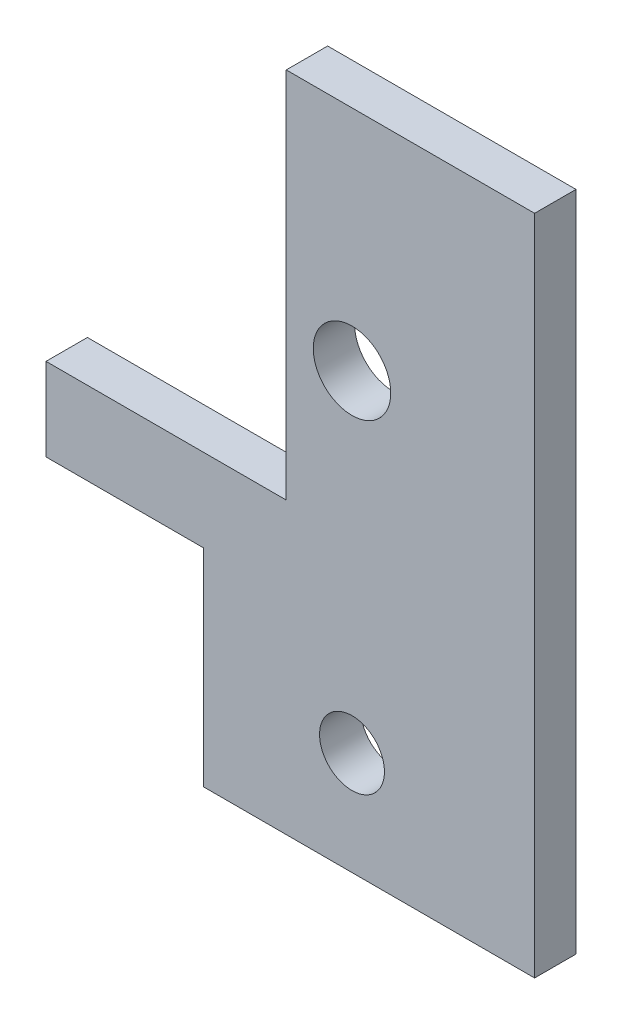
ISO-10303-21;
HEADER;
FILE_DESCRIPTION(('STEP AP214'),'2;1');
FILE_NAME('part.step','',(''),(''),'','','');
FILE_SCHEMA(('AUTOMOTIVE_DESIGN { 1 0 10303 214 1 1 1 1 }'));
ENDSEC;
DATA;
#1=APPLICATION_CONTEXT('core data for automotive mechanical design processes');
#2=APPLICATION_PROTOCOL_DEFINITION('international standard','automotive_design',2000,#1);
#3=PRODUCT_CONTEXT('',#1,'mechanical');
#4=PRODUCT('Part','Part','',(#3));
#5=PRODUCT_RELATED_PRODUCT_CATEGORY('part','',(#4));
#6=PRODUCT_DEFINITION_FORMATION('','',#4);
#7=PRODUCT_DEFINITION_CONTEXT('part definition',#1,'design');
#8=PRODUCT_DEFINITION('design','',#6,#7);
#9=PRODUCT_DEFINITION_SHAPE('','',#8);
#10=(LENGTH_UNIT() NAMED_UNIT(*) SI_UNIT(.MILLI.,.METRE.));
#11=(NAMED_UNIT(*) PLANE_ANGLE_UNIT() SI_UNIT($,.RADIAN.));
#12=(NAMED_UNIT(*) SI_UNIT($,.STERADIAN.) SOLID_ANGLE_UNIT());
#13=UNCERTAINTY_MEASURE_WITH_UNIT(LENGTH_MEASURE(1.E-05),#10,'distance_accuracy_value','');
#14=(GEOMETRIC_REPRESENTATION_CONTEXT(3) GLOBAL_UNCERTAINTY_ASSIGNED_CONTEXT((#13)) GLOBAL_UNIT_ASSIGNED_CONTEXT((#10,
#11,#12)) REPRESENTATION_CONTEXT('',''));
#15=CARTESIAN_POINT('',(0.,0.,0.));
#16=DIRECTION('',(0.,0.,1.));
#17=DIRECTION('',(1.,0.,0.));
#18=AXIS2_PLACEMENT_3D('',#15,#16,#17);
#19=CARTESIAN_POINT('',(18.4276999999991,0.,3.175));
#20=DIRECTION('',(1.,0.,0.));
#21=DIRECTION('',(0.,1.,0.));
#22=AXIS2_PLACEMENT_3D('',#19,#20,#21);
#23=PLANE('',#22);
#24=DIRECTION('',(0.,-1.,0.));
#25=VECTOR('',#24,1.);
#26=CARTESIAN_POINT('',(18.4276999999991,0.,0.));
#27=LINE('',#26,#25);
#28=CARTESIAN_POINT('',(18.4276999999991,9.5377,0.));
#29=VERTEX_POINT('',#28);
#30=CARTESIAN_POINT('',(18.4276999999991,-19.0373,0.));
#31=VERTEX_POINT('',#30);
#32=EDGE_CURVE('E51',#29,#31,#27,.T.);
#33=ORIENTED_EDGE('',*,*,#32,.T.);
#34=DIRECTION('',(0.,0.,-1.));
#35=VECTOR('',#34,1.);
#36=CARTESIAN_POINT('',(18.4276999999991,-19.0373,3.175));
#37=LINE('',#36,#35);
#38=CARTESIAN_POINT('',(18.4276999999991,-19.0373,3.175));
#39=VERTEX_POINT('',#38);
#40=EDGE_CURVE('E11',#39,#31,#37,.T.);
#41=ORIENTED_EDGE('',*,*,#40,.F.);
#42=DIRECTION('',(0.,-1.,0.));
#43=VECTOR('',#42,1.);
#44=CARTESIAN_POINT('',(18.4276999999991,0.,3.175));
#45=LINE('',#44,#43);
#46=CARTESIAN_POINT('',(18.4276999999991,9.5377,3.175));
#47=VERTEX_POINT('',#46);
#48=EDGE_CURVE('E294',#47,#39,#45,.T.);
#49=ORIENTED_EDGE('',*,*,#48,.F.);
#50=DIRECTION('',(0.,0.,-1.));
#51=VECTOR('',#50,1.);
#52=CARTESIAN_POINT('',(18.4276999999991,9.5377,3.175));
#53=LINE('',#52,#51);
#54=EDGE_CURVE('E176',#47,#29,#53,.T.);
#55=ORIENTED_EDGE('',*,*,#54,.T.);
#56=EDGE_LOOP('',(#33,#41,#49,#55));
#57=FACE_BOUND('',#56,.T.);
#58=ADVANCED_FACE('F36',(#57),#23,.F.);
#59=CARTESIAN_POINT('',(0.,-19.0373,3.175));
#60=DIRECTION('',(0.,-1.,0.));
#61=DIRECTION('',(1.,0.,0.));
#62=AXIS2_PLACEMENT_3D('',#59,#60,#61);
#63=PLANE('',#62);
#64=DIRECTION('',(-1.,0.,0.));
#65=VECTOR('',#64,1.);
#66=CARTESIAN_POINT('',(0.,-19.0373,0.));
#67=LINE('',#66,#65);
#68=CARTESIAN_POINT('',(0.,-19.0373,0.));
#69=VERTEX_POINT('',#68);
#70=EDGE_CURVE('E151',#31,#69,#67,.T.);
#71=ORIENTED_EDGE('',*,*,#70,.T.);
#72=DIRECTION('',(0.,0.,-1.));
#73=VECTOR('',#72,1.);
#74=CARTESIAN_POINT('',(0.,-19.0373,3.175));
#75=LINE('',#74,#73);
#76=CARTESIAN_POINT('',(0.,-19.0373,3.175));
#77=VERTEX_POINT('',#76);
#78=EDGE_CURVE('E44',#77,#69,#75,.T.);
#79=ORIENTED_EDGE('',*,*,#78,.F.);
#80=DIRECTION('',(-1.,0.,0.));
#81=VECTOR('',#80,1.);
#82=CARTESIAN_POINT('',(0.,-19.0373,3.175));
#83=LINE('',#82,#81);
#84=EDGE_CURVE('E94',#39,#77,#83,.T.);
#85=ORIENTED_EDGE('',*,*,#84,.F.);
#86=ORIENTED_EDGE('',*,*,#40,.T.);
#87=EDGE_LOOP('',(#71,#79,#85,#86));
#88=FACE_BOUND('',#87,.T.);
#89=ADVANCED_FACE('F152',(#88),#63,.F.);
#90=CARTESIAN_POINT('',(0.,0.,3.175));
#91=DIRECTION('',(1.,0.,0.));
#92=DIRECTION('',(0.,1.,0.));
#93=AXIS2_PLACEMENT_3D('',#90,#91,#92);
#94=PLANE('',#93);
#95=DIRECTION('',(0.,-1.,0.));
#96=VECTOR('',#95,1.);
#97=CARTESIAN_POINT('',(0.,0.,0.));
#98=LINE('',#97,#96);
#99=CARTESIAN_POINT('',(0.,-25.3873,0.));
#100=VERTEX_POINT('',#99);
#101=EDGE_CURVE('E149',#69,#100,#98,.T.);
#102=ORIENTED_EDGE('',*,*,#101,.T.);
#103=DIRECTION('',(0.,0.,-1.));
#104=VECTOR('',#103,1.);
#105=CARTESIAN_POINT('',(0.,-25.3873,3.175));
#106=LINE('',#105,#104);
#107=CARTESIAN_POINT('',(0.,-25.3873,3.175));
#108=VERTEX_POINT('',#107);
#109=EDGE_CURVE('E136',#108,#100,#106,.T.);
#110=ORIENTED_EDGE('',*,*,#109,.F.);
#111=DIRECTION('',(0.,-1.,0.));
#112=VECTOR('',#111,1.);
#113=CARTESIAN_POINT('',(0.,0.,3.175));
#114=LINE('',#113,#112);
#115=EDGE_CURVE('E150',#77,#108,#114,.T.);
#116=ORIENTED_EDGE('',*,*,#115,.F.);
#117=ORIENTED_EDGE('',*,*,#78,.T.);
#118=EDGE_LOOP('',(#102,#110,#116,#117));
#119=FACE_BOUND('',#118,.T.);
#120=ADVANCED_FACE('F147',(#119),#94,.F.);
#121=CARTESIAN_POINT('',(0.,-25.3873,3.175));
#122=DIRECTION('',(0.,1.,0.));
#123=DIRECTION('',(-1.,0.,0.));
#124=AXIS2_PLACEMENT_3D('',#121,#122,#123);
#125=PLANE('',#124);
#126=DIRECTION('',(1.,0.,0.));
#127=VECTOR('',#126,1.);
#128=CARTESIAN_POINT('',(0.,-25.3873,0.));
#129=LINE('',#128,#127);
#130=CARTESIAN_POINT('',(12.0776999999991,-25.3873,0.));
#131=VERTEX_POINT('',#130);
#132=EDGE_CURVE('E155',#100,#131,#129,.T.);
#133=ORIENTED_EDGE('',*,*,#132,.T.);
#134=DIRECTION('',(0.,0.,-1.));
#135=VECTOR('',#134,1.);
#136=CARTESIAN_POINT('',(12.0776999999991,-25.3873,3.175));
#137=LINE('',#136,#135);
#138=CARTESIAN_POINT('',(12.0776999999991,-25.3873,3.175));
#139=VERTEX_POINT('',#138);
#140=EDGE_CURVE('E134',#139,#131,#137,.T.);
#141=ORIENTED_EDGE('',*,*,#140,.F.);
#142=DIRECTION('',(1.,0.,0.));
#143=VECTOR('',#142,1.);
#144=CARTESIAN_POINT('',(0.,-25.3873,3.175));
#145=LINE('',#144,#143);
#146=EDGE_CURVE('E127',#108,#139,#145,.T.);
#147=ORIENTED_EDGE('',*,*,#146,.F.);
#148=ORIENTED_EDGE('',*,*,#109,.T.);
#149=EDGE_LOOP('',(#133,#141,#147,#148));
#150=FACE_BOUND('',#149,.T.);
#151=ADVANCED_FACE('F202',(#150),#125,.F.);
#152=CARTESIAN_POINT('',(12.0776999999991,0.,3.175));
#153=DIRECTION('',(1.,0.,0.));
#154=DIRECTION('',(0.,1.,0.));
#155=AXIS2_PLACEMENT_3D('',#152,#153,#154);
#156=PLANE('',#155);
#157=DIRECTION('',(0.,-1.,0.));
#158=VECTOR('',#157,1.);
#159=CARTESIAN_POINT('',(12.0776999999991,0.,0.));
#160=LINE('',#159,#158);
#161=CARTESIAN_POINT('',(12.0776999999991,-41.2623,0.));
#162=VERTEX_POINT('',#161);
#163=EDGE_CURVE('E133',#131,#162,#160,.T.);
#164=ORIENTED_EDGE('',*,*,#163,.T.);
#165=DIRECTION('',(0.,0.,-1.));
#166=VECTOR('',#165,1.);
#167=CARTESIAN_POINT('',(12.0776999999991,-41.2623,3.175));
#168=LINE('',#167,#166);
#169=CARTESIAN_POINT('',(12.0776999999991,-41.2623,3.175));
#170=VERTEX_POINT('',#169);
#171=EDGE_CURVE('E115',#170,#162,#168,.T.);
#172=ORIENTED_EDGE('',*,*,#171,.F.);
#173=DIRECTION('',(0.,-1.,0.));
#174=VECTOR('',#173,1.);
#175=CARTESIAN_POINT('',(12.0776999999991,0.,3.175));
#176=LINE('',#175,#174);
#177=EDGE_CURVE('E121',#139,#170,#176,.T.);
#178=ORIENTED_EDGE('',*,*,#177,.F.);
#179=ORIENTED_EDGE('',*,*,#140,.T.);
#180=EDGE_LOOP('',(#164,#172,#178,#179));
#181=FACE_BOUND('',#180,.T.);
#182=ADVANCED_FACE('F132',(#181),#156,.F.);
#183=CARTESIAN_POINT('',(0.,-41.2623,3.175));
#184=DIRECTION('',(0.,1.,0.));
#185=DIRECTION('',(-1.,0.,0.));
#186=AXIS2_PLACEMENT_3D('',#183,#184,#185);
#187=PLANE('',#186);
#188=DIRECTION('',(1.,0.,0.));
#189=VECTOR('',#188,1.);
#190=CARTESIAN_POINT('',(0.,-41.2623,0.));
#191=LINE('',#190,#189);
#192=CARTESIAN_POINT('',(37.4776999999991,-41.2623,0.));
#193=VERTEX_POINT('',#192);
#194=EDGE_CURVE('E164',#162,#193,#191,.T.);
#195=ORIENTED_EDGE('',*,*,#194,.T.);
#196=DIRECTION('',(0.,0.,-1.));
#197=VECTOR('',#196,1.);
#198=CARTESIAN_POINT('',(37.4776999999991,-41.2623,3.175));
#199=LINE('',#198,#197);
#200=CARTESIAN_POINT('',(37.4776999999991,-41.2623,3.175));
#201=VERTEX_POINT('',#200);
#202=EDGE_CURVE('E118',#201,#193,#199,.T.);
#203=ORIENTED_EDGE('',*,*,#202,.F.);
#204=DIRECTION('',(1.,0.,0.));
#205=VECTOR('',#204,1.);
#206=CARTESIAN_POINT('',(0.,-41.2623,3.175));
#207=LINE('',#206,#205);
#208=EDGE_CURVE('E110',#170,#201,#207,.T.);
#209=ORIENTED_EDGE('',*,*,#208,.F.);
#210=ORIENTED_EDGE('',*,*,#171,.T.);
#211=EDGE_LOOP('',(#195,#203,#209,#210));
#212=FACE_BOUND('',#211,.T.);
#213=ADVANCED_FACE('F113',(#212),#187,.F.);
#214=CARTESIAN_POINT('',(37.4776999999991,0.,3.175));
#215=DIRECTION('',(-1.,0.,0.));
#216=DIRECTION('',(0.,0.,1.));
#217=AXIS2_PLACEMENT_3D('',#214,#215,#216);
#218=PLANE('',#217);
#219=DIRECTION('',(0.,1.,0.));
#220=VECTOR('',#219,1.);
#221=CARTESIAN_POINT('',(37.4776999999991,0.,0.));
#222=LINE('',#221,#220);
#223=CARTESIAN_POINT('',(37.4776999999991,9.5377,0.));
#224=VERTEX_POINT('',#223);
#225=EDGE_CURVE('E166',#193,#224,#222,.T.);
#226=ORIENTED_EDGE('',*,*,#225,.T.);
#227=DIRECTION('',(0.,0.,-1.));
#228=VECTOR('',#227,1.);
#229=CARTESIAN_POINT('',(37.4776999999991,9.5377,3.175));
#230=LINE('',#229,#228);
#231=CARTESIAN_POINT('',(37.4776999999991,9.5377,3.175));
#232=VERTEX_POINT('',#231);
#233=EDGE_CURVE('E138',#232,#224,#230,.T.);
#234=ORIENTED_EDGE('',*,*,#233,.F.);
#235=DIRECTION('',(0.,1.,0.));
#236=VECTOR('',#235,1.);
#237=CARTESIAN_POINT('',(37.4776999999991,0.,3.175));
#238=LINE('',#237,#236);
#239=EDGE_CURVE('E120',#201,#232,#238,.T.);
#240=ORIENTED_EDGE('',*,*,#239,.F.);
#241=ORIENTED_EDGE('',*,*,#202,.T.);
#242=EDGE_LOOP('',(#226,#234,#240,#241));
#243=FACE_BOUND('',#242,.T.);
#244=ADVANCED_FACE('F191',(#243),#218,.F.);
#245=CARTESIAN_POINT('',(0.,9.5377,3.175));
#246=DIRECTION('',(0.,-1.,0.));
#247=DIRECTION('',(0.,0.,-1.));
#248=AXIS2_PLACEMENT_3D('',#245,#246,#247);
#249=PLANE('',#248);
#250=DIRECTION('',(-1.,0.,0.));
#251=VECTOR('',#250,1.);
#252=CARTESIAN_POINT('',(0.,9.5377,0.));
#253=LINE('',#252,#251);
#254=EDGE_CURVE('E87',#224,#29,#253,.T.);
#255=ORIENTED_EDGE('',*,*,#254,.T.);
#256=ORIENTED_EDGE('',*,*,#54,.F.);
#257=DIRECTION('',(-1.,0.,0.));
#258=VECTOR('',#257,1.);
#259=CARTESIAN_POINT('',(0.,9.5377,3.175));
#260=LINE('',#259,#258);
#261=EDGE_CURVE('E60',#232,#47,#260,.T.);
#262=ORIENTED_EDGE('',*,*,#261,.F.);
#263=ORIENTED_EDGE('',*,*,#233,.T.);
#264=EDGE_LOOP('',(#255,#256,#262,#263));
#265=FACE_BOUND('',#264,.T.);
#266=ADVANCED_FACE('F184',(#265),#249,.F.);
#267=CARTESIAN_POINT('',(23.4715819172548,-33.3248,3.175));
#268=DIRECTION('',(0.,0.,-1.));
#269=DIRECTION('',(-1.,0.,0.));
#270=AXIS2_PLACEMENT_3D('',#267,#268,#269);
#271=CYLINDRICAL_SURFACE('',#270,2.4892);
#272=CARTESIAN_POINT('',(23.4715819172548,-33.3248,3.175));
#273=DIRECTION('',(0.,0.,1.));
#274=DIRECTION('',(1.,0.,0.));
#275=AXIS2_PLACEMENT_3D('',#272,#273,#274);
#276=CIRCLE('',#275,2.4892);
#277=CARTESIAN_POINT('',(25.9607819172548,-33.3248,3.175));
#278=VERTEX_POINT('',#277);
#279=EDGE_CURVE('E298',#278,#278,#276,.T.);
#280=ORIENTED_EDGE('',*,*,#279,.T.);
#281=EDGE_LOOP('',(#280));
#282=FACE_BOUND('',#281,.T.);
#283=CARTESIAN_POINT('',(23.4715819172548,-33.3248,0.));
#284=DIRECTION('',(0.,0.,1.));
#285=DIRECTION('',(1.,0.,0.));
#286=AXIS2_PLACEMENT_3D('',#283,#284,#285);
#287=CIRCLE('',#286,2.4892);
#288=CARTESIAN_POINT('',(25.9607819172548,-33.3248,0.));
#289=VERTEX_POINT('',#288);
#290=EDGE_CURVE('E157',#289,#289,#287,.T.);
#291=ORIENTED_EDGE('',*,*,#290,.F.);
#292=EDGE_LOOP('',(#291));
#293=FACE_BOUND('',#292,.T.);
#294=ADVANCED_FACE('F182',(#282,#293),#271,.F.);
#295=CARTESIAN_POINT('',(23.4715819172548,-7.9248,3.175));
#296=DIRECTION('',(0.,0.,-1.));
#297=DIRECTION('',(-1.,0.,0.));
#298=AXIS2_PLACEMENT_3D('',#295,#296,#297);
#299=CYLINDRICAL_SURFACE('',#298,2.9718);
#300=CARTESIAN_POINT('',(23.4715819172548,-7.9248,3.175));
#301=DIRECTION('',(0.,0.,1.));
#302=DIRECTION('',(1.,0.,0.));
#303=AXIS2_PLACEMENT_3D('',#300,#301,#302);
#304=CIRCLE('',#303,2.9718);
#305=CARTESIAN_POINT('',(26.4433819172548,-7.9248,3.175));
#306=VERTEX_POINT('',#305);
#307=EDGE_CURVE('E169',#306,#306,#304,.T.);
#308=ORIENTED_EDGE('',*,*,#307,.T.);
#309=EDGE_LOOP('',(#308));
#310=FACE_BOUND('',#309,.T.);
#311=CARTESIAN_POINT('',(23.4715819172548,-7.9248,0.));
#312=DIRECTION('',(0.,0.,1.));
#313=DIRECTION('',(1.,0.,0.));
#314=AXIS2_PLACEMENT_3D('',#311,#312,#313);
#315=CIRCLE('',#314,2.9718);
#316=CARTESIAN_POINT('',(26.4433819172548,-7.9248,0.));
#317=VERTEX_POINT('',#316);
#318=EDGE_CURVE('E174',#317,#317,#315,.T.);
#319=ORIENTED_EDGE('',*,*,#318,.F.);
#320=EDGE_LOOP('',(#319));
#321=FACE_BOUND('',#320,.T.);
#322=ADVANCED_FACE('F38',(#310,#321),#299,.F.);
#323=CARTESIAN_POINT('',(0.,0.,3.175));
#324=DIRECTION('',(0.,0.,1.));
#325=DIRECTION('',(1.,0.,0.));
#326=AXIS2_PLACEMENT_3D('',#323,#324,#325);
#327=PLANE('',#326);
#328=ORIENTED_EDGE('',*,*,#261,.T.);
#329=ORIENTED_EDGE('',*,*,#48,.T.);
#330=ORIENTED_EDGE('',*,*,#84,.T.);
#331=ORIENTED_EDGE('',*,*,#115,.T.);
#332=ORIENTED_EDGE('',*,*,#146,.T.);
#333=ORIENTED_EDGE('',*,*,#177,.T.);
#334=ORIENTED_EDGE('',*,*,#208,.T.);
#335=ORIENTED_EDGE('',*,*,#239,.T.);
#336=EDGE_LOOP('',(#328,#329,#330,#331,#332,#333,#334,#335));
#337=FACE_BOUND('',#336,.T.);
#338=ORIENTED_EDGE('',*,*,#307,.F.);
#339=EDGE_LOOP('',(#338));
#340=FACE_BOUND('',#339,.T.);
#341=ORIENTED_EDGE('',*,*,#279,.F.);
#342=EDGE_LOOP('',(#341));
#343=FACE_BOUND('',#342,.T.);
#344=ADVANCED_FACE('F124',(#337,#340,#343),#327,.T.);
#345=CARTESIAN_POINT('',(0.,0.,0.));
#346=DIRECTION('',(0.,0.,1.));
#347=DIRECTION('',(1.,0.,0.));
#348=AXIS2_PLACEMENT_3D('',#345,#346,#347);
#349=PLANE('',#348);
#350=ORIENTED_EDGE('',*,*,#318,.T.);
#351=EDGE_LOOP('',(#350));
#352=FACE_BOUND('',#351,.T.);
#353=ORIENTED_EDGE('',*,*,#290,.T.);
#354=EDGE_LOOP('',(#353));
#355=FACE_BOUND('',#354,.T.);
#356=ORIENTED_EDGE('',*,*,#32,.F.);
#357=ORIENTED_EDGE('',*,*,#254,.F.);
#358=ORIENTED_EDGE('',*,*,#225,.F.);
#359=ORIENTED_EDGE('',*,*,#194,.F.);
#360=ORIENTED_EDGE('',*,*,#163,.F.);
#361=ORIENTED_EDGE('',*,*,#132,.F.);
#362=ORIENTED_EDGE('',*,*,#101,.F.);
#363=ORIENTED_EDGE('',*,*,#70,.F.);
#364=EDGE_LOOP('',(#356,#357,#358,#359,#360,#361,#362,#363));
#365=FACE_BOUND('',#364,.T.);
#366=ADVANCED_FACE('F180',(#352,#355,#365),#349,.F.);
#367=CLOSED_SHELL('',(#58,#89,#120,#151,#182,#213,#244,#266,#294,#322,#344,#366));
#368=MANIFOLD_SOLID_BREP('B2',#367);
#369=ADVANCED_BREP_SHAPE_REPRESENTATION('',(#18,#368),#14);
#370=SHAPE_DEFINITION_REPRESENTATION(#9,#369);
ENDSEC;
END-ISO-10303-21;
